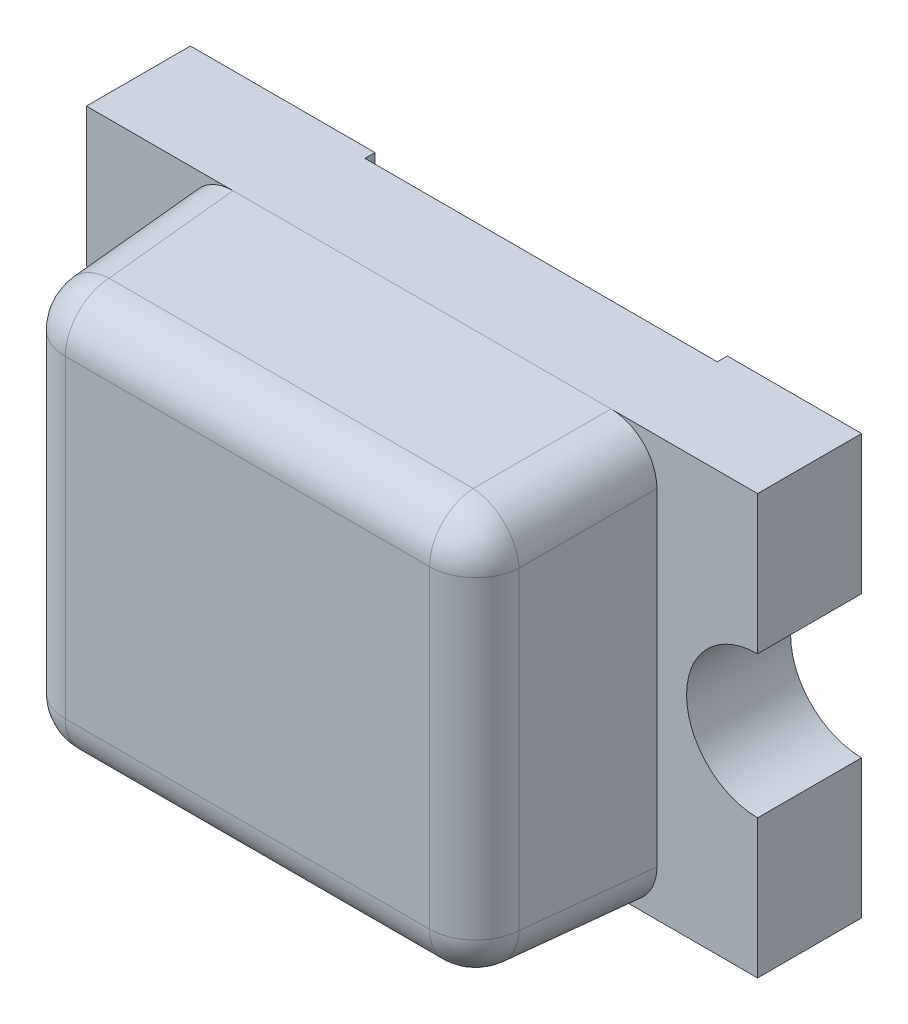
ISO-10303-21;
HEADER;
FILE_DESCRIPTION(('STEP AP214'),'2;1');
FILE_NAME('part.step','',(''),(''),'','','');
FILE_SCHEMA(('AUTOMOTIVE_DESIGN { 1 0 10303 214 1 1 1 1 }'));
ENDSEC;
DATA;
#1=APPLICATION_CONTEXT('core data for automotive mechanical design processes');
#2=APPLICATION_PROTOCOL_DEFINITION('international standard','automotive_design',2000,#1);
#3=PRODUCT_CONTEXT('',#1,'mechanical');
#4=PRODUCT('Part','Part','',(#3));
#5=PRODUCT_RELATED_PRODUCT_CATEGORY('part','',(#4));
#6=PRODUCT_DEFINITION_FORMATION('','',#4);
#7=PRODUCT_DEFINITION_CONTEXT('part definition',#1,'design');
#8=PRODUCT_DEFINITION('design','',#6,#7);
#9=PRODUCT_DEFINITION_SHAPE('','',#8);
#10=(LENGTH_UNIT() NAMED_UNIT(*) SI_UNIT(.MILLI.,.METRE.));
#11=(NAMED_UNIT(*) PLANE_ANGLE_UNIT() SI_UNIT($,.RADIAN.));
#12=(NAMED_UNIT(*) SI_UNIT($,.STERADIAN.) SOLID_ANGLE_UNIT());
#13=UNCERTAINTY_MEASURE_WITH_UNIT(LENGTH_MEASURE(1.E-05),#10,'distance_accuracy_value','');
#14=(GEOMETRIC_REPRESENTATION_CONTEXT(3) GLOBAL_UNCERTAINTY_ASSIGNED_CONTEXT((#13)) GLOBAL_UNIT_ASSIGNED_CONTEXT((#10,
#11,#12)) REPRESENTATION_CONTEXT('',''));
#15=CARTESIAN_POINT('',(0.,0.,0.));
#16=DIRECTION('',(0.,0.,1.));
#17=DIRECTION('',(1.,0.,0.));
#18=AXIS2_PLACEMENT_3D('',#15,#16,#17);
#19=CARTESIAN_POINT('',(0.163168531233106,-0.486831468766896,0.325652261310296));
#20=DIRECTION('',(-0.0522644276887139,-0.0522644276887139,-0.997264688634237));
#21=DIRECTION('',(0.,0.998629534754574,-0.0523359562429438));
#22=AXIS2_PLACEMENT_3D('',#19,#20,#21);
#23=CYLINDRICAL_SURFACE('',#22,0.13716);
#24=CARTESIAN_POINT('',(0.182412025197795,-0.467587974802207,0.69284));
#25=DIRECTION('',(0.052264427688714,0.052264427688714,0.997264688634237));
#26=DIRECTION('',(0.,-0.998629534754574,0.0523359562429439));
#27=AXIS2_PLACEMENT_3D('',#24,#25,#26);
#28=CIRCLE('',#27,0.13716);
#29=CARTESIAN_POINT('',(0.0454399982108576,-0.467587974802207,0.700018399758282));
#30=VERTEX_POINT('',#29);
#31=CARTESIAN_POINT('',(0.182412025197795,-0.604560001789144,0.700018399758282));
#32=VERTEX_POINT('',#31);
#33=EDGE_CURVE('E409',#30,#32,#28,.T.);
#34=ORIENTED_EDGE('',*,*,#33,.F.);
#35=DIRECTION('',(0.0522644276887139,0.0522644276887139,0.997264688634237));
#36=VECTOR('',#35,1.);
#37=CARTESIAN_POINT('',(0.02633308276625,-0.486694890246814,0.335436734478859));
#38=LINE('',#37,#36);
#39=CARTESIAN_POINT('',(0.0250000000000006,-0.488027973013064,0.31));
#40=VERTEX_POINT('',#39);
#41=EDGE_CURVE('E43',#40,#30,#38,.T.);
#42=ORIENTED_EDGE('',*,*,#41,.F.);
#43=CARTESIAN_POINT('',(0.162348230977076,-0.487651769022926,0.31));
#44=DIRECTION('',(0.,0.,1.));
#45=DIRECTION('',(-0.707106781186547,-0.707106781186548,0.));
#46=AXIS2_PLACEMENT_3D('',#43,#44,#45);
#47=ELLIPSE('',#46,0.137536204342943,0.13716);
#48=CARTESIAN_POINT('',(0.161972026986938,-0.625,0.31));
#49=VERTEX_POINT('',#48);
#50=EDGE_CURVE('E11',#40,#49,#47,.T.);
#51=ORIENTED_EDGE('',*,*,#50,.T.);
#52=DIRECTION('',(0.0522644276887139,0.0522644276887139,0.997264688634237));
#53=VECTOR('',#52,1.);
#54=CARTESIAN_POINT('',(0.163168531233106,-0.623803495753833,0.332830661068578));
#55=LINE('',#54,#53);
#56=EDGE_CURVE('E29',#49,#32,#55,.T.);
#57=ORIENTED_EDGE('',*,*,#56,.T.);
#58=EDGE_LOOP('',(#34,#42,#51,#57));
#59=FACE_BOUND('',#58,.T.);
#60=ADVANCED_FACE('F18',(#59),#23,.T.);
#61=CARTESIAN_POINT('',(0.182412025197795,-0.467587974802207,0.69284));
#62=DIRECTION('',(0.,0.,1.));
#63=DIRECTION('',(1.,0.,0.));
#64=AXIS2_PLACEMENT_3D('',#61,#62,#63);
#65=SPHERICAL_SURFACE('',#64,0.13716);
#66=CARTESIAN_POINT('',(0.182412025197795,-0.467587974802207,0.69284));
#67=DIRECTION('',(-1.,0.,0.));
#68=DIRECTION('',(0.,0.,1.));
#69=AXIS2_PLACEMENT_3D('',#66,#67,#68);
#70=CIRCLE('',#69,0.13716);
#71=CARTESIAN_POINT('',(0.182412025197795,-0.467587974802207,0.83));
#72=VERTEX_POINT('',#71);
#73=EDGE_CURVE('E327',#32,#72,#70,.T.);
#74=ORIENTED_EDGE('',*,*,#73,.T.);
#75=CARTESIAN_POINT('',(0.182412025197795,-0.467587974802207,0.69284));
#76=DIRECTION('',(0.,-1.,0.));
#77=DIRECTION('',(0.,0.,-1.));
#78=AXIS2_PLACEMENT_3D('',#75,#76,#77);
#79=CIRCLE('',#78,0.13716);
#80=EDGE_CURVE('E331',#72,#30,#79,.T.);
#81=ORIENTED_EDGE('',*,*,#80,.T.);
#82=ORIENTED_EDGE('',*,*,#33,.T.);
#83=EDGE_LOOP('',(#74,#81,#82));
#84=FACE_BOUND('',#83,.T.);
#85=ADVANCED_FACE('F615',(#84),#65,.T.);
#86=CARTESIAN_POINT('',(0.,-0.467587974802207,0.69284));
#87=DIRECTION('',(1.,0.,0.));
#88=DIRECTION('',(0.,1.,0.));
#89=AXIS2_PLACEMENT_3D('',#86,#87,#88);
#90=CYLINDRICAL_SURFACE('',#89,0.13716);
#91=CARTESIAN_POINT('',(1.26758797480221,-0.467587974802207,0.69284));
#92=DIRECTION('',(1.,0.,0.));
#93=DIRECTION('',(0.,0.,-1.));
#94=AXIS2_PLACEMENT_3D('',#91,#92,#93);
#95=CIRCLE('',#94,0.13716);
#96=CARTESIAN_POINT('',(1.26758797480221,-0.467587974802207,0.83));
#97=VERTEX_POINT('',#96);
#98=CARTESIAN_POINT('',(1.26758797480221,-0.604560001789144,0.700018399758282));
#99=VERTEX_POINT('',#98);
#100=EDGE_CURVE('E257',#97,#99,#95,.T.);
#101=ORIENTED_EDGE('',*,*,#100,.F.);
#102=DIRECTION('',(-1.,0.,0.));
#103=VECTOR('',#102,1.);
#104=CARTESIAN_POINT('',(1.39774795477282,-0.467587974802207,0.83));
#105=LINE('',#104,#103);
#106=EDGE_CURVE('E22',#97,#72,#105,.T.);
#107=ORIENTED_EDGE('',*,*,#106,.T.);
#108=ORIENTED_EDGE('',*,*,#73,.F.);
#109=DIRECTION('',(1.,0.,0.));
#110=VECTOR('',#109,1.);
#111=CARTESIAN_POINT('',(0.0522520452271821,-0.604560001789144,0.700018399758282));
#112=LINE('',#111,#110);
#113=EDGE_CURVE('E290',#32,#99,#112,.T.);
#114=ORIENTED_EDGE('',*,*,#113,.T.);
#115=EDGE_LOOP('',(#101,#107,#108,#114));
#116=FACE_BOUND('',#115,.T.);
#117=ADVANCED_FACE('F679',(#116),#90,.T.);
#118=CARTESIAN_POINT('',(0.182412025197795,0.,0.69284));
#119=DIRECTION('',(0.,-1.,0.));
#120=DIRECTION('',(1.,0.,0.));
#121=AXIS2_PLACEMENT_3D('',#118,#119,#120);
#122=CYLINDRICAL_SURFACE('',#121,0.13716);
#123=CARTESIAN_POINT('',(0.182412025197795,0.467587974802206,0.69284));
#124=DIRECTION('',(0.,1.,0.));
#125=DIRECTION('',(0.,0.,1.));
#126=AXIS2_PLACEMENT_3D('',#123,#124,#125);
#127=CIRCLE('',#126,0.13716);
#128=CARTESIAN_POINT('',(0.0454399982108576,0.467587974802206,0.700018399758282));
#129=VERTEX_POINT('',#128);
#130=CARTESIAN_POINT('',(0.182412025197795,0.467587974802206,0.83));
#131=VERTEX_POINT('',#130);
#132=EDGE_CURVE('E264',#129,#131,#127,.T.);
#133=ORIENTED_EDGE('',*,*,#132,.F.);
#134=DIRECTION('',(0.,-1.,0.));
#135=VECTOR('',#134,1.);
#136=CARTESIAN_POINT('',(0.0454399982108575,0.597747954772819,0.700018399758282));
#137=LINE('',#136,#135);
#138=EDGE_CURVE('E268',#129,#30,#137,.T.);
#139=ORIENTED_EDGE('',*,*,#138,.T.);
#140=ORIENTED_EDGE('',*,*,#80,.F.);
#141=DIRECTION('',(0.,1.,0.));
#142=VECTOR('',#141,1.);
#143=CARTESIAN_POINT('',(0.182412025197795,-0.597747954772819,0.83));
#144=LINE('',#143,#142);
#145=EDGE_CURVE('E270',#72,#131,#144,.T.);
#146=ORIENTED_EDGE('',*,*,#145,.T.);
#147=EDGE_LOOP('',(#133,#139,#140,#146));
#148=FACE_BOUND('',#147,.T.);
#149=ADVANCED_FACE('F266',(#148),#122,.T.);
#150=CARTESIAN_POINT('',(1.26758797480221,-0.467587974802207,0.69284));
#151=DIRECTION('',(0.,0.,1.));
#152=DIRECTION('',(1.,0.,0.));
#153=AXIS2_PLACEMENT_3D('',#150,#151,#152);
#154=SPHERICAL_SURFACE('',#153,0.13716);
#155=CARTESIAN_POINT('',(1.26758797480221,-0.467587974802206,0.69284));
#156=DIRECTION('',(-0.052264427688714,0.052264427688714,0.997264688634237));
#157=DIRECTION('',(0.,-0.998629534754574,0.0523359562429439));
#158=AXIS2_PLACEMENT_3D('',#155,#156,#157);
#159=CIRCLE('',#158,0.13716);
#160=CARTESIAN_POINT('',(1.40456000178914,-0.467587974802207,0.700018399758282));
#161=VERTEX_POINT('',#160);
#162=EDGE_CURVE('E366',#99,#161,#159,.T.);
#163=ORIENTED_EDGE('',*,*,#162,.T.);
#164=CARTESIAN_POINT('',(1.26758797480221,-0.467587974802207,0.69284));
#165=DIRECTION('',(0.,-1.,0.));
#166=DIRECTION('',(0.,0.,-1.));
#167=AXIS2_PLACEMENT_3D('',#164,#165,#166);
#168=CIRCLE('',#167,0.13716);
#169=EDGE_CURVE('E387',#161,#97,#168,.T.);
#170=ORIENTED_EDGE('',*,*,#169,.T.);
#171=ORIENTED_EDGE('',*,*,#100,.T.);
#172=EDGE_LOOP('',(#163,#170,#171));
#173=FACE_BOUND('',#172,.T.);
#174=ADVANCED_FACE('F680',(#173),#154,.T.);
#175=CARTESIAN_POINT('',(0.182412025197795,0.467587974802206,0.69284));
#176=DIRECTION('',(0.,0.,1.));
#177=DIRECTION('',(1.,0.,0.));
#178=AXIS2_PLACEMENT_3D('',#175,#176,#177);
#179=SPHERICAL_SURFACE('',#178,0.13716);
#180=CARTESIAN_POINT('',(0.182412025197795,0.467587974802206,0.69284));
#181=DIRECTION('',(-1.,0.,0.));
#182=DIRECTION('',(0.,-1.,0.));
#183=AXIS2_PLACEMENT_3D('',#180,#181,#182);
#184=CIRCLE('',#183,0.13716);
#185=CARTESIAN_POINT('',(0.182412025197795,0.604560001789144,0.700018399758282));
#186=VERTEX_POINT('',#185);
#187=EDGE_CURVE('E281',#131,#186,#184,.T.);
#188=ORIENTED_EDGE('',*,*,#187,.T.);
#189=CARTESIAN_POINT('',(0.182412025197795,0.467587974802206,0.69284));
#190=DIRECTION('',(0.052264427688714,-0.052264427688714,0.997264688634237));
#191=DIRECTION('',(0.998629534754574,0.,-0.0523359562429439));
#192=AXIS2_PLACEMENT_3D('',#189,#190,#191);
#193=CIRCLE('',#192,0.13716);
#194=EDGE_CURVE('E276',#186,#129,#193,.T.);
#195=ORIENTED_EDGE('',*,*,#194,.T.);
#196=ORIENTED_EDGE('',*,*,#132,.T.);
#197=EDGE_LOOP('',(#188,#195,#196));
#198=FACE_BOUND('',#197,.T.);
#199=ADVANCED_FACE('F280',(#198),#179,.T.);
#200=CARTESIAN_POINT('',(1.28669489024681,-0.486694890246814,0.328258334720577));
#201=DIRECTION('',(0.0522644276887139,-0.0522644276887139,-0.997264688634237));
#202=DIRECTION('',(-0.998629534754574,0.,-0.0523359562429438));
#203=AXIS2_PLACEMENT_3D('',#200,#201,#202);
#204=CYLINDRICAL_SURFACE('',#203,0.13716);
#205=CARTESIAN_POINT('',(1.28765176902293,-0.487651769022926,0.31));
#206=DIRECTION('',(0.,0.,1.));
#207=DIRECTION('',(0.707106781186548,-0.707106781186547,0.));
#208=AXIS2_PLACEMENT_3D('',#205,#206,#207);
#209=ELLIPSE('',#208,0.137536204342943,0.13716);
#210=CARTESIAN_POINT('',(1.28802797301306,-0.625,0.31));
#211=VERTEX_POINT('',#210);
#212=CARTESIAN_POINT('',(1.425,-0.488027973013063,0.31));
#213=VERTEX_POINT('',#212);
#214=EDGE_CURVE('E277',#211,#213,#209,.T.);
#215=ORIENTED_EDGE('',*,*,#214,.T.);
#216=DIRECTION('',(-0.0522644276887139,0.0522644276887139,0.997264688634237));
#217=VECTOR('',#216,1.);
#218=CARTESIAN_POINT('',(1.42366691723375,-0.486694890246814,0.335436734478859));
#219=LINE('',#218,#217);
#220=EDGE_CURVE('E437',#213,#161,#219,.T.);
#221=ORIENTED_EDGE('',*,*,#220,.T.);
#222=ORIENTED_EDGE('',*,*,#162,.F.);
#223=DIRECTION('',(-0.0522644276887139,0.0522644276887139,0.997264688634237));
#224=VECTOR('',#223,1.);
#225=CARTESIAN_POINT('',(1.28614857616649,-0.623120603153426,0.345861028119986));
#226=LINE('',#225,#224);
#227=EDGE_CURVE('E520',#211,#99,#226,.T.);
#228=ORIENTED_EDGE('',*,*,#227,.F.);
#229=EDGE_LOOP('',(#215,#221,#222,#228));
#230=FACE_BOUND('',#229,.T.);
#231=ADVANCED_FACE('F676',(#230),#204,.T.);
#232=CARTESIAN_POINT('',(1.26758797480221,0.,0.69284));
#233=DIRECTION('',(0.,1.,0.));
#234=DIRECTION('',(-1.,0.,0.));
#235=AXIS2_PLACEMENT_3D('',#232,#233,#234);
#236=CYLINDRICAL_SURFACE('',#235,0.13716);
#237=CARTESIAN_POINT('',(1.26758797480221,0.467587974802206,0.69284));
#238=DIRECTION('',(0.,1.,0.));
#239=DIRECTION('',(0.,0.,1.));
#240=AXIS2_PLACEMENT_3D('',#237,#238,#239);
#241=CIRCLE('',#240,0.13716);
#242=CARTESIAN_POINT('',(1.26758797480221,0.467587974802206,0.83));
#243=VERTEX_POINT('',#242);
#244=CARTESIAN_POINT('',(1.40456000178914,0.467587974802206,0.700018399758282));
#245=VERTEX_POINT('',#244);
#246=EDGE_CURVE('E297',#243,#245,#241,.T.);
#247=ORIENTED_EDGE('',*,*,#246,.F.);
#248=DIRECTION('',(0.,-1.,0.));
#249=VECTOR('',#248,1.);
#250=CARTESIAN_POINT('',(1.26758797480221,0.597747954772819,0.83));
#251=LINE('',#250,#249);
#252=EDGE_CURVE('E434',#243,#97,#251,.T.);
#253=ORIENTED_EDGE('',*,*,#252,.T.);
#254=ORIENTED_EDGE('',*,*,#169,.F.);
#255=DIRECTION('',(0.,1.,0.));
#256=VECTOR('',#255,1.);
#257=CARTESIAN_POINT('',(1.40456000178914,-0.597747954772819,0.700018399758282));
#258=LINE('',#257,#256);
#259=EDGE_CURVE('E438',#161,#245,#258,.T.);
#260=ORIENTED_EDGE('',*,*,#259,.T.);
#261=EDGE_LOOP('',(#247,#253,#254,#260));
#262=FACE_BOUND('',#261,.T.);
#263=ADVANCED_FACE('F684',(#262),#236,.T.);
#264=CARTESIAN_POINT('',(0.,0.467587974802206,0.69284));
#265=DIRECTION('',(-1.,0.,0.));
#266=DIRECTION('',(0.,0.,1.));
#267=AXIS2_PLACEMENT_3D('',#264,#265,#266);
#268=CYLINDRICAL_SURFACE('',#267,0.13716);
#269=CARTESIAN_POINT('',(1.26758797480221,0.467587974802206,0.69284));
#270=DIRECTION('',(1.,0.,0.));
#271=DIRECTION('',(0.,0.,-1.));
#272=AXIS2_PLACEMENT_3D('',#269,#270,#271);
#273=CIRCLE('',#272,0.13716);
#274=CARTESIAN_POINT('',(1.26758797480221,0.604560001789144,0.700018399758282));
#275=VERTEX_POINT('',#274);
#276=EDGE_CURVE('E394',#275,#243,#273,.T.);
#277=ORIENTED_EDGE('',*,*,#276,.F.);
#278=DIRECTION('',(-1.,0.,0.));
#279=VECTOR('',#278,1.);
#280=CARTESIAN_POINT('',(1.39774795477282,0.604560001789144,0.700018399758282));
#281=LINE('',#280,#279);
#282=EDGE_CURVE('E447',#275,#186,#281,.T.);
#283=ORIENTED_EDGE('',*,*,#282,.T.);
#284=ORIENTED_EDGE('',*,*,#187,.F.);
#285=DIRECTION('',(1.,0.,0.));
#286=VECTOR('',#285,1.);
#287=CARTESIAN_POINT('',(0.052252045227182,0.467587974802206,0.83));
#288=LINE('',#287,#286);
#289=EDGE_CURVE('E303',#131,#243,#288,.T.);
#290=ORIENTED_EDGE('',*,*,#289,.T.);
#291=EDGE_LOOP('',(#277,#283,#284,#290));
#292=FACE_BOUND('',#291,.T.);
#293=ADVANCED_FACE('F622',(#292),#268,.T.);
#294=CARTESIAN_POINT('',(0.163305109753187,0.486694890246814,0.328258334720577));
#295=DIRECTION('',(-0.0522644276887139,0.0522644276887139,-0.997264688634237));
#296=DIRECTION('',(-0.998629534754574,0.,0.0523359562429438));
#297=AXIS2_PLACEMENT_3D('',#294,#295,#296);
#298=CYLINDRICAL_SURFACE('',#297,0.13716);
#299=CARTESIAN_POINT('',(0.162348230977075,0.487651769022926,0.31));
#300=DIRECTION('',(0.,0.,1.));
#301=DIRECTION('',(-0.707106781186548,0.707106781186548,0.));
#302=AXIS2_PLACEMENT_3D('',#299,#300,#301);
#303=ELLIPSE('',#302,0.137536204342943,0.13716);
#304=CARTESIAN_POINT('',(0.161972026986938,0.625,0.31));
#305=VERTEX_POINT('',#304);
#306=CARTESIAN_POINT('',(0.0250000000000006,0.488027973013063,0.31));
#307=VERTEX_POINT('',#306);
#308=EDGE_CURVE('E294',#305,#307,#303,.T.);
#309=ORIENTED_EDGE('',*,*,#308,.T.);
#310=DIRECTION('',(0.0522644276887139,-0.0522644276887139,0.997264688634237));
#311=VECTOR('',#310,1.);
#312=CARTESIAN_POINT('',(0.02633308276625,0.486694890246814,0.335436734478859));
#313=LINE('',#312,#311);
#314=EDGE_CURVE('E287',#307,#129,#313,.T.);
#315=ORIENTED_EDGE('',*,*,#314,.T.);
#316=ORIENTED_EDGE('',*,*,#194,.F.);
#317=DIRECTION('',(0.0522644276887139,-0.0522644276887139,0.997264688634237));
#318=VECTOR('',#317,1.);
#319=CARTESIAN_POINT('',(0.163168531233106,0.623803495753833,0.332830661068578));
#320=LINE('',#319,#318);
#321=EDGE_CURVE('E519',#305,#186,#320,.T.);
#322=ORIENTED_EDGE('',*,*,#321,.F.);
#323=EDGE_LOOP('',(#309,#315,#316,#322));
#324=FACE_BOUND('',#323,.T.);
#325=ADVANCED_FACE('F292',(#324),#298,.T.);
#326=CARTESIAN_POINT('',(1.26758797480221,0.467587974802206,0.69284));
#327=DIRECTION('',(0.,0.,1.));
#328=DIRECTION('',(1.,0.,0.));
#329=AXIS2_PLACEMENT_3D('',#326,#327,#328);
#330=SPHERICAL_SURFACE('',#329,0.13716);
#331=ORIENTED_EDGE('',*,*,#246,.T.);
#332=CARTESIAN_POINT('',(1.26758797480221,0.467587974802206,0.69284));
#333=DIRECTION('',(-0.052264427688714,-0.0522644276887141,0.997264688634237));
#334=DIRECTION('',(0.,-0.998629534754574,-0.052335956242944));
#335=AXIS2_PLACEMENT_3D('',#332,#333,#334);
#336=CIRCLE('',#335,0.13716);
#337=EDGE_CURVE('E307',#245,#275,#336,.T.);
#338=ORIENTED_EDGE('',*,*,#337,.T.);
#339=ORIENTED_EDGE('',*,*,#276,.T.);
#340=EDGE_LOOP('',(#331,#338,#339));
#341=FACE_BOUND('',#340,.T.);
#342=ADVANCED_FACE('F686',(#341),#330,.T.);
#343=CARTESIAN_POINT('',(1.28614857616649,0.486148576166488,0.338682628361704));
#344=DIRECTION('',(0.0522644276887139,0.0522644276887139,-0.997264688634237));
#345=DIRECTION('',(0.,0.998629534754574,0.0523359562429438));
#346=AXIS2_PLACEMENT_3D('',#343,#344,#345);
#347=CYLINDRICAL_SURFACE('',#346,0.13716);
#348=ORIENTED_EDGE('',*,*,#337,.F.);
#349=DIRECTION('',(-0.0522644276887139,-0.0522644276887139,0.997264688634237));
#350=VECTOR('',#349,1.);
#351=CARTESIAN_POINT('',(1.42366691723375,0.486694890246814,0.335436734478859));
#352=LINE('',#351,#350);
#353=CARTESIAN_POINT('',(1.425,0.488027973013063,0.31));
#354=VERTEX_POINT('',#353);
#355=EDGE_CURVE('E86',#354,#245,#352,.T.);
#356=ORIENTED_EDGE('',*,*,#355,.F.);
#357=CARTESIAN_POINT('',(1.28765176902293,0.487651769022926,0.31));
#358=DIRECTION('',(0.,0.,1.));
#359=DIRECTION('',(0.707106781186548,0.707106781186548,0.));
#360=AXIS2_PLACEMENT_3D('',#357,#358,#359);
#361=ELLIPSE('',#360,0.137536204342943,0.13716);
#362=CARTESIAN_POINT('',(1.28802797301306,0.625,0.31));
#363=VERTEX_POINT('',#362);
#364=EDGE_CURVE('E397',#354,#363,#361,.T.);
#365=ORIENTED_EDGE('',*,*,#364,.T.);
#366=DIRECTION('',(-0.0522644276887139,-0.0522644276887139,0.997264688634237));
#367=VECTOR('',#366,1.);
#368=CARTESIAN_POINT('',(1.28614857616649,0.623120603153425,0.345861028119986));
#369=LINE('',#368,#367);
#370=EDGE_CURVE('E563',#363,#275,#369,.T.);
#371=ORIENTED_EDGE('',*,*,#370,.T.);
#372=EDGE_LOOP('',(#348,#356,#365,#371));
#373=FACE_BOUND('',#372,.T.);
#374=ADVANCED_FACE('F625',(#373),#347,.T.);
#375=CARTESIAN_POINT('',(0.,0.,0.83));
#376=DIRECTION('',(0.,0.,1.));
#377=DIRECTION('',(1.,0.,0.));
#378=AXIS2_PLACEMENT_3D('',#375,#376,#377);
#379=PLANE('',#378);
#380=ORIENTED_EDGE('',*,*,#145,.F.);
#381=ORIENTED_EDGE('',*,*,#106,.F.);
#382=ORIENTED_EDGE('',*,*,#252,.F.);
#383=ORIENTED_EDGE('',*,*,#289,.F.);
#384=EDGE_LOOP('',(#380,#381,#382,#383));
#385=FACE_BOUND('',#384,.T.);
#386=ADVANCED_FACE('F619',(#385),#379,.T.);
#387=CARTESIAN_POINT('',(0.6,0.625,0.31));
#388=DIRECTION('',(0.,0.998629534754574,0.0523359562429438));
#389=DIRECTION('',(1.,0.,0.));
#390=AXIS2_PLACEMENT_3D('',#387,#388,#389);
#391=PLANE('',#390);
#392=DIRECTION('',(1.,0.,0.));
#393=VECTOR('',#392,1.);
#394=CARTESIAN_POINT('',(0.6,0.625,0.31));
#395=LINE('',#394,#393);
#396=EDGE_CURVE('E71',#305,#363,#395,.T.);
#397=ORIENTED_EDGE('',*,*,#396,.F.);
#398=ORIENTED_EDGE('',*,*,#321,.T.);
#399=ORIENTED_EDGE('',*,*,#282,.F.);
#400=ORIENTED_EDGE('',*,*,#370,.F.);
#401=EDGE_LOOP('',(#397,#398,#399,#400));
#402=FACE_BOUND('',#401,.T.);
#403=ADVANCED_FACE('F624',(#402),#391,.T.);
#404=CARTESIAN_POINT('',(1.425,0.,0.31));
#405=DIRECTION('',(0.998629534754574,0.,0.0523359562429438));
#406=DIRECTION('',(0.,-1.,0.));
#407=AXIS2_PLACEMENT_3D('',#404,#405,#406);
#408=PLANE('',#407);
#409=ORIENTED_EDGE('',*,*,#259,.F.);
#410=ORIENTED_EDGE('',*,*,#220,.F.);
#411=DIRECTION('',(0.,-1.,0.));
#412=VECTOR('',#411,1.);
#413=CARTESIAN_POINT('',(1.425,0.,0.31));
#414=LINE('',#413,#412);
#415=EDGE_CURVE('E479',#354,#213,#414,.T.);
#416=ORIENTED_EDGE('',*,*,#415,.F.);
#417=ORIENTED_EDGE('',*,*,#355,.T.);
#418=EDGE_LOOP('',(#409,#410,#416,#417));
#419=FACE_BOUND('',#418,.T.);
#420=ADVANCED_FACE('F758',(#419),#408,.T.);
#421=CARTESIAN_POINT('',(0.6,-0.625,0.31));
#422=DIRECTION('',(0.,-0.998629534754574,0.0523359562429438));
#423=DIRECTION('',(-1.,0.,0.));
#424=AXIS2_PLACEMENT_3D('',#421,#422,#423);
#425=PLANE('',#424);
#426=ORIENTED_EDGE('',*,*,#113,.F.);
#427=ORIENTED_EDGE('',*,*,#56,.F.);
#428=DIRECTION('',(-1.,0.,0.));
#429=VECTOR('',#428,1.);
#430=CARTESIAN_POINT('',(0.6,-0.625,0.31));
#431=LINE('',#430,#429);
#432=EDGE_CURVE('E378',#211,#49,#431,.T.);
#433=ORIENTED_EDGE('',*,*,#432,.F.);
#434=ORIENTED_EDGE('',*,*,#227,.T.);
#435=EDGE_LOOP('',(#426,#427,#433,#434));
#436=FACE_BOUND('',#435,.T.);
#437=ADVANCED_FACE('F20',(#436),#425,.T.);
#438=CARTESIAN_POINT('',(0.0250000000000006,0.,0.31));
#439=DIRECTION('',(-0.998629534754574,0.,0.0523359562429438));
#440=DIRECTION('',(0.,1.,0.));
#441=AXIS2_PLACEMENT_3D('',#438,#439,#440);
#442=PLANE('',#441);
#443=DIRECTION('',(0.,1.,0.));
#444=VECTOR('',#443,1.);
#445=CARTESIAN_POINT('',(0.0250000000000006,0.,0.31));
#446=LINE('',#445,#444);
#447=EDGE_CURVE('E314',#40,#307,#446,.T.);
#448=ORIENTED_EDGE('',*,*,#447,.F.);
#449=ORIENTED_EDGE('',*,*,#41,.T.);
#450=ORIENTED_EDGE('',*,*,#138,.F.);
#451=ORIENTED_EDGE('',*,*,#314,.F.);
#452=EDGE_LOOP('',(#448,#449,#450,#451));
#453=FACE_BOUND('',#452,.T.);
#454=ADVANCED_FACE('F286',(#453),#442,.T.);
#455=CARTESIAN_POINT('',(-0.275,0.,0.));
#456=DIRECTION('',(0.,0.,1.));
#457=DIRECTION('',(1.,0.,0.));
#458=AXIS2_PLACEMENT_3D('',#455,#456,#457);
#459=PLANE('',#458);
#460=DIRECTION('',(0.,1.,0.));
#461=VECTOR('',#460,1.);
#462=CARTESIAN_POINT('',(-0.275,0.211688070581402,0.));
#463=LINE('',#462,#461);
#464=CARTESIAN_POINT('',(-0.275,0.211688070581401,0.));
#465=VERTEX_POINT('',#464);
#466=CARTESIAN_POINT('',(-0.275,0.625,0.));
#467=VERTEX_POINT('',#466);
#468=EDGE_CURVE('E443',#465,#467,#463,.T.);
#469=ORIENTED_EDGE('',*,*,#468,.T.);
#470=DIRECTION('',(1.,0.,0.));
#471=VECTOR('',#470,1.);
#472=CARTESIAN_POINT('',(-0.275,0.625,0.));
#473=LINE('',#472,#471);
#474=CARTESIAN_POINT('',(0.275,0.625,0.));
#475=VERTEX_POINT('',#474);
#476=EDGE_CURVE('E439',#467,#475,#473,.T.);
#477=ORIENTED_EDGE('',*,*,#476,.T.);
#478=DIRECTION('',(0.,-1.,0.));
#479=VECTOR('',#478,1.);
#480=CARTESIAN_POINT('',(0.275,0.625,0.));
#481=LINE('',#480,#479);
#482=CARTESIAN_POINT('',(0.275,-0.625,0.));
#483=VERTEX_POINT('',#482);
#484=EDGE_CURVE('E325',#475,#483,#481,.T.);
#485=ORIENTED_EDGE('',*,*,#484,.T.);
#486=DIRECTION('',(-1.,0.,0.));
#487=VECTOR('',#486,1.);
#488=CARTESIAN_POINT('',(0.275,-0.625,0.));
#489=LINE('',#488,#487);
#490=CARTESIAN_POINT('',(-0.275,-0.625,0.));
#491=VERTEX_POINT('',#490);
#492=EDGE_CURVE('E321',#483,#491,#489,.T.);
#493=ORIENTED_EDGE('',*,*,#492,.T.);
#494=DIRECTION('',(0.,1.,0.));
#495=VECTOR('',#494,1.);
#496=CARTESIAN_POINT('',(-0.275,-0.625,0.));
#497=LINE('',#496,#495);
#498=CARTESIAN_POINT('',(-0.275,-0.211688070581402,0.));
#499=VERTEX_POINT('',#498);
#500=EDGE_CURVE('E326',#491,#499,#497,.T.);
#501=ORIENTED_EDGE('',*,*,#500,.T.);
#502=CARTESIAN_POINT('',(-0.275,0.,0.));
#503=DIRECTION('',(0.,0.,1.));
#504=DIRECTION('',(-1.,0.,0.));
#505=AXIS2_PLACEMENT_3D('',#502,#503,#504);
#506=CIRCLE('',#505,0.211688070581401);
#507=EDGE_CURVE('E457',#499,#465,#506,.T.);
#508=ORIENTED_EDGE('',*,*,#507,.T.);
#509=EDGE_LOOP('',(#469,#477,#485,#493,#501,#508));
#510=FACE_BOUND('',#509,.T.);
#511=ADVANCED_FACE('F602',(#510),#459,.F.);
#512=CARTESIAN_POINT('',(-0.275,0.,0.03));
#513=DIRECTION('',(0.,0.,-1.));
#514=DIRECTION('',(-1.,0.,0.));
#515=AXIS2_PLACEMENT_3D('',#512,#513,#514);
#516=CYLINDRICAL_SURFACE('',#515,0.211688070581401);
#517=ORIENTED_EDGE('',*,*,#507,.F.);
#518=DIRECTION('',(0.,0.,-1.));
#519=VECTOR('',#518,1.);
#520=CARTESIAN_POINT('',(-0.275,-0.211688070581402,0.03));
#521=LINE('',#520,#519);
#522=CARTESIAN_POINT('',(-0.275,-0.211688070581402,0.31));
#523=VERTEX_POINT('',#522);
#524=EDGE_CURVE('E336',#523,#499,#521,.T.);
#525=ORIENTED_EDGE('',*,*,#524,.F.);
#526=CARTESIAN_POINT('',(-0.275,0.,0.31));
#527=DIRECTION('',(0.,0.,1.));
#528=DIRECTION('',(-1.,0.,0.));
#529=AXIS2_PLACEMENT_3D('',#526,#527,#528);
#530=CIRCLE('',#529,0.211688070581401);
#531=CARTESIAN_POINT('',(-0.275,0.211688070581401,0.31));
#532=VERTEX_POINT('',#531);
#533=EDGE_CURVE('E488',#523,#532,#530,.T.);
#534=ORIENTED_EDGE('',*,*,#533,.T.);
#535=DIRECTION('',(0.,0.,-1.));
#536=VECTOR('',#535,1.);
#537=CARTESIAN_POINT('',(-0.275,0.211688070581401,0.03));
#538=LINE('',#537,#536);
#539=EDGE_CURVE('E492',#532,#465,#538,.T.);
#540=ORIENTED_EDGE('',*,*,#539,.T.);
#541=EDGE_LOOP('',(#517,#525,#534,#540));
#542=FACE_BOUND('',#541,.T.);
#543=ADVANCED_FACE('F592',(#542),#516,.F.);
#544=CARTESIAN_POINT('',(-0.275,-0.625,0.03));
#545=DIRECTION('',(-1.,0.,0.));
#546=DIRECTION('',(0.,0.,1.));
#547=AXIS2_PLACEMENT_3D('',#544,#545,#546);
#548=PLANE('',#547);
#549=ORIENTED_EDGE('',*,*,#500,.F.);
#550=DIRECTION('',(0.,0.,-1.));
#551=VECTOR('',#550,1.);
#552=CARTESIAN_POINT('',(-0.275,-0.625,0.03));
#553=LINE('',#552,#551);
#554=CARTESIAN_POINT('',(-0.275,-0.625,0.31));
#555=VERTEX_POINT('',#554);
#556=EDGE_CURVE('E473',#555,#491,#553,.T.);
#557=ORIENTED_EDGE('',*,*,#556,.F.);
#558=DIRECTION('',(0.,1.,0.));
#559=VECTOR('',#558,1.);
#560=CARTESIAN_POINT('',(-0.275,-0.211688070581402,0.31));
#561=LINE('',#560,#559);
#562=EDGE_CURVE('E524',#555,#523,#561,.T.);
#563=ORIENTED_EDGE('',*,*,#562,.T.);
#564=ORIENTED_EDGE('',*,*,#524,.T.);
#565=EDGE_LOOP('',(#549,#557,#563,#564));
#566=FACE_BOUND('',#565,.T.);
#567=ADVANCED_FACE('F588',(#566),#548,.T.);
#568=CARTESIAN_POINT('',(0.275,-0.625,0.03));
#569=DIRECTION('',(0.,-1.,0.));
#570=DIRECTION('',(0.,0.,-1.));
#571=AXIS2_PLACEMENT_3D('',#568,#569,#570);
#572=PLANE('',#571);
#573=ORIENTED_EDGE('',*,*,#492,.F.);
#574=DIRECTION('',(0.,0.,-1.));
#575=VECTOR('',#574,1.);
#576=CARTESIAN_POINT('',(0.275,-0.625,0.03));
#577=LINE('',#576,#575);
#578=CARTESIAN_POINT('',(0.275,-0.625,0.03));
#579=VERTEX_POINT('',#578);
#580=EDGE_CURVE('E410',#579,#483,#577,.T.);
#581=ORIENTED_EDGE('',*,*,#580,.F.);
#582=DIRECTION('',(-1.,0.,0.));
#583=VECTOR('',#582,1.);
#584=CARTESIAN_POINT('',(1.725,-0.625,0.03));
#585=LINE('',#584,#583);
#586=CARTESIAN_POINT('',(1.325,-0.625,0.03));
#587=VERTEX_POINT('',#586);
#588=EDGE_CURVE('E476',#587,#579,#585,.T.);
#589=ORIENTED_EDGE('',*,*,#588,.F.);
#590=DIRECTION('',(0.,0.,-1.));
#591=VECTOR('',#590,1.);
#592=CARTESIAN_POINT('',(1.325,-0.625,0.03));
#593=LINE('',#592,#591);
#594=CARTESIAN_POINT('',(1.325,-0.625,0.));
#595=VERTEX_POINT('',#594);
#596=EDGE_CURVE('E332',#587,#595,#593,.T.);
#597=ORIENTED_EDGE('',*,*,#596,.T.);
#598=DIRECTION('',(-1.,0.,0.));
#599=VECTOR('',#598,1.);
#600=CARTESIAN_POINT('',(1.725,-0.625,0.));
#601=LINE('',#600,#599);
#602=CARTESIAN_POINT('',(1.725,-0.625,0.));
#603=VERTEX_POINT('',#602);
#604=EDGE_CURVE('E415',#603,#595,#601,.T.);
#605=ORIENTED_EDGE('',*,*,#604,.F.);
#606=DIRECTION('',(0.,0.,-1.));
#607=VECTOR('',#606,1.);
#608=CARTESIAN_POINT('',(1.725,-0.625,0.03));
#609=LINE('',#608,#607);
#610=CARTESIAN_POINT('',(1.725,-0.625,0.31));
#611=VERTEX_POINT('',#610);
#612=EDGE_CURVE('E398',#611,#603,#609,.T.);
#613=ORIENTED_EDGE('',*,*,#612,.F.);
#614=DIRECTION('',(-1.,0.,0.));
#615=VECTOR('',#614,1.);
#616=CARTESIAN_POINT('',(1.725,-0.625,0.31));
#617=LINE('',#616,#615);
#618=EDGE_CURVE('E337',#611,#211,#617,.T.);
#619=ORIENTED_EDGE('',*,*,#618,.T.);
#620=ORIENTED_EDGE('',*,*,#432,.T.);
#621=DIRECTION('',(-1.,0.,0.));
#622=VECTOR('',#621,1.);
#623=CARTESIAN_POINT('',(1.725,-0.625,0.31));
#624=LINE('',#623,#622);
#625=EDGE_CURVE('E469',#49,#555,#624,.T.);
#626=ORIENTED_EDGE('',*,*,#625,.T.);
#627=ORIENTED_EDGE('',*,*,#556,.T.);
#628=EDGE_LOOP('',(#573,#581,#589,#597,#605,#613,#619,#620,#626,#627));
#629=FACE_BOUND('',#628,.T.);
#630=ADVANCED_FACE('F605',(#629),#572,.T.);
#631=CARTESIAN_POINT('',(0.275,0.625,0.03));
#632=DIRECTION('',(1.,0.,0.));
#633=DIRECTION('',(0.,1.,0.));
#634=AXIS2_PLACEMENT_3D('',#631,#632,#633);
#635=PLANE('',#634);
#636=ORIENTED_EDGE('',*,*,#484,.F.);
#637=DIRECTION('',(0.,0.,-1.));
#638=VECTOR('',#637,1.);
#639=CARTESIAN_POINT('',(0.275,0.625,0.03));
#640=LINE('',#639,#638);
#641=CARTESIAN_POINT('',(0.275,0.625,0.03));
#642=VERTEX_POINT('',#641);
#643=EDGE_CURVE('E391',#642,#475,#640,.T.);
#644=ORIENTED_EDGE('',*,*,#643,.F.);
#645=DIRECTION('',(0.,-1.,0.));
#646=VECTOR('',#645,1.);
#647=CARTESIAN_POINT('',(0.275,0.625,0.03));
#648=LINE('',#647,#646);
#649=EDGE_CURVE('E413',#642,#579,#648,.T.);
#650=ORIENTED_EDGE('',*,*,#649,.T.);
#651=ORIENTED_EDGE('',*,*,#580,.T.);
#652=EDGE_LOOP('',(#636,#644,#650,#651));
#653=FACE_BOUND('',#652,.T.);
#654=ADVANCED_FACE('F639',(#653),#635,.T.);
#655=CARTESIAN_POINT('',(-0.275,0.625,0.03));
#656=DIRECTION('',(0.,1.,0.));
#657=DIRECTION('',(1.,0.,0.));
#658=AXIS2_PLACEMENT_3D('',#655,#656,#657);
#659=PLANE('',#658);
#660=ORIENTED_EDGE('',*,*,#476,.F.);
#661=DIRECTION('',(0.,0.,-1.));
#662=VECTOR('',#661,1.);
#663=CARTESIAN_POINT('',(-0.275,0.625,0.03));
#664=LINE('',#663,#662);
#665=CARTESIAN_POINT('',(-0.275,0.625,0.31));
#666=VERTEX_POINT('',#665);
#667=EDGE_CURVE('E392',#666,#467,#664,.T.);
#668=ORIENTED_EDGE('',*,*,#667,.F.);
#669=DIRECTION('',(1.,0.,0.));
#670=VECTOR('',#669,1.);
#671=CARTESIAN_POINT('',(-0.275,0.625,0.31));
#672=LINE('',#671,#670);
#673=EDGE_CURVE('E414',#666,#305,#672,.T.);
#674=ORIENTED_EDGE('',*,*,#673,.T.);
#675=ORIENTED_EDGE('',*,*,#396,.T.);
#676=DIRECTION('',(1.,0.,0.));
#677=VECTOR('',#676,1.);
#678=CARTESIAN_POINT('',(-0.275,0.625,0.31));
#679=LINE('',#678,#677);
#680=CARTESIAN_POINT('',(1.725,0.625,0.31));
#681=VERTEX_POINT('',#680);
#682=EDGE_CURVE('E505',#363,#681,#679,.T.);
#683=ORIENTED_EDGE('',*,*,#682,.T.);
#684=DIRECTION('',(0.,0.,-1.));
#685=VECTOR('',#684,1.);
#686=CARTESIAN_POINT('',(1.725,0.625,0.03));
#687=LINE('',#686,#685);
#688=CARTESIAN_POINT('',(1.725,0.625,0.));
#689=VERTEX_POINT('',#688);
#690=EDGE_CURVE('E501',#681,#689,#687,.T.);
#691=ORIENTED_EDGE('',*,*,#690,.T.);
#692=DIRECTION('',(1.,0.,0.));
#693=VECTOR('',#692,1.);
#694=CARTESIAN_POINT('',(1.325,0.625,0.));
#695=LINE('',#694,#693);
#696=CARTESIAN_POINT('',(1.325,0.625,0.));
#697=VERTEX_POINT('',#696);
#698=EDGE_CURVE('E316',#697,#689,#695,.T.);
#699=ORIENTED_EDGE('',*,*,#698,.F.);
#700=DIRECTION('',(0.,0.,-1.));
#701=VECTOR('',#700,1.);
#702=CARTESIAN_POINT('',(1.325,0.625,0.03));
#703=LINE('',#702,#701);
#704=CARTESIAN_POINT('',(1.325,0.625,0.03));
#705=VERTEX_POINT('',#704);
#706=EDGE_CURVE('E312',#705,#697,#703,.T.);
#707=ORIENTED_EDGE('',*,*,#706,.F.);
#708=DIRECTION('',(1.,0.,0.));
#709=VECTOR('',#708,1.);
#710=CARTESIAN_POINT('',(-0.275,0.625,0.03));
#711=LINE('',#710,#709);
#712=EDGE_CURVE('E463',#642,#705,#711,.T.);
#713=ORIENTED_EDGE('',*,*,#712,.F.);
#714=ORIENTED_EDGE('',*,*,#643,.T.);
#715=EDGE_LOOP('',(#660,#668,#674,#675,#683,#691,#699,#707,#713,#714));
#716=FACE_BOUND('',#715,.T.);
#717=ADVANCED_FACE('F633',(#716),#659,.T.);
#718=CARTESIAN_POINT('',(-0.275,0.211688070581402,0.03));
#719=DIRECTION('',(-1.,0.,0.));
#720=DIRECTION('',(0.,0.,1.));
#721=AXIS2_PLACEMENT_3D('',#718,#719,#720);
#722=PLANE('',#721);
#723=ORIENTED_EDGE('',*,*,#468,.F.);
#724=ORIENTED_EDGE('',*,*,#539,.F.);
#725=DIRECTION('',(0.,1.,0.));
#726=VECTOR('',#725,1.);
#727=CARTESIAN_POINT('',(-0.275,0.211688070581401,0.31));
#728=LINE('',#727,#726);
#729=EDGE_CURVE('E388',#532,#666,#728,.T.);
#730=ORIENTED_EDGE('',*,*,#729,.T.);
#731=ORIENTED_EDGE('',*,*,#667,.T.);
#732=EDGE_LOOP('',(#723,#724,#730,#731));
#733=FACE_BOUND('',#732,.T.);
#734=ADVANCED_FACE('F600',(#733),#722,.T.);
#735=CARTESIAN_POINT('',(1.725,0.,0.03));
#736=DIRECTION('',(0.,0.,1.));
#737=DIRECTION('',(1.,0.,0.));
#738=AXIS2_PLACEMENT_3D('',#735,#736,#737);
#739=PLANE('',#738);
#740=ORIENTED_EDGE('',*,*,#649,.F.);
#741=ORIENTED_EDGE('',*,*,#712,.T.);
#742=DIRECTION('',(0.,1.,0.));
#743=VECTOR('',#742,1.);
#744=CARTESIAN_POINT('',(1.325,0.2,0.03));
#745=LINE('',#744,#743);
#746=CARTESIAN_POINT('',(1.325,0.2,0.03));
#747=VERTEX_POINT('',#746);
#748=EDGE_CURVE('E313',#747,#705,#745,.T.);
#749=ORIENTED_EDGE('',*,*,#748,.F.);
#750=DIRECTION('',(1.,0.,0.));
#751=VECTOR('',#750,1.);
#752=CARTESIAN_POINT('',(1.325,0.2,0.03));
#753=LINE('',#752,#751);
#754=CARTESIAN_POINT('',(1.175,0.2,0.03));
#755=VERTEX_POINT('',#754);
#756=EDGE_CURVE('E371',#755,#747,#753,.T.);
#757=ORIENTED_EDGE('',*,*,#756,.F.);
#758=DIRECTION('',(0.,1.,0.));
#759=VECTOR('',#758,1.);
#760=CARTESIAN_POINT('',(1.175,0.2,0.03));
#761=LINE('',#760,#759);
#762=CARTESIAN_POINT('',(1.175,-0.2,0.03));
#763=VERTEX_POINT('',#762);
#764=EDGE_CURVE('E352',#763,#755,#761,.T.);
#765=ORIENTED_EDGE('',*,*,#764,.F.);
#766=DIRECTION('',(-1.,0.,0.));
#767=VECTOR('',#766,1.);
#768=CARTESIAN_POINT('',(1.175,-0.2,0.03));
#769=LINE('',#768,#767);
#770=CARTESIAN_POINT('',(1.325,-0.2,0.03));
#771=VERTEX_POINT('',#770);
#772=EDGE_CURVE('E353',#771,#763,#769,.T.);
#773=ORIENTED_EDGE('',*,*,#772,.F.);
#774=DIRECTION('',(0.,1.,0.));
#775=VECTOR('',#774,1.);
#776=CARTESIAN_POINT('',(1.325,-0.625,0.03));
#777=LINE('',#776,#775);
#778=EDGE_CURVE('E363',#587,#771,#777,.T.);
#779=ORIENTED_EDGE('',*,*,#778,.F.);
#780=ORIENTED_EDGE('',*,*,#588,.T.);
#781=EDGE_LOOP('',(#740,#741,#749,#757,#765,#773,#779,#780));
#782=FACE_BOUND('',#781,.T.);
#783=ADVANCED_FACE('F641',(#782),#739,.F.);
#784=CARTESIAN_POINT('',(1.725,0.,0.31));
#785=DIRECTION('',(0.,0.,1.));
#786=DIRECTION('',(1.,0.,0.));
#787=AXIS2_PLACEMENT_3D('',#784,#785,#786);
#788=PLANE('',#787);
#789=ORIENTED_EDGE('',*,*,#415,.T.);
#790=ORIENTED_EDGE('',*,*,#214,.F.);
#791=ORIENTED_EDGE('',*,*,#618,.F.);
#792=DIRECTION('',(0.,-1.,0.));
#793=VECTOR('',#792,1.);
#794=CARTESIAN_POINT('',(1.725,-0.211688070581401,0.31));
#795=LINE('',#794,#793);
#796=CARTESIAN_POINT('',(1.725,-0.211688070581401,0.31));
#797=VERTEX_POINT('',#796);
#798=EDGE_CURVE('E401',#797,#611,#795,.T.);
#799=ORIENTED_EDGE('',*,*,#798,.F.);
#800=CARTESIAN_POINT('',(1.725,0.,0.31));
#801=DIRECTION('',(0.,0.,1.));
#802=DIRECTION('',(1.,0.,0.));
#803=AXIS2_PLACEMENT_3D('',#800,#801,#802);
#804=CIRCLE('',#803,0.211688070581401);
#805=CARTESIAN_POINT('',(1.725,0.211688070581401,0.31));
#806=VERTEX_POINT('',#805);
#807=EDGE_CURVE('E402',#806,#797,#804,.T.);
#808=ORIENTED_EDGE('',*,*,#807,.F.);
#809=DIRECTION('',(0.,-1.,0.));
#810=VECTOR('',#809,1.);
#811=CARTESIAN_POINT('',(1.725,0.625,0.31));
#812=LINE('',#811,#810);
#813=EDGE_CURVE('E358',#681,#806,#812,.T.);
#814=ORIENTED_EDGE('',*,*,#813,.F.);
#815=ORIENTED_EDGE('',*,*,#682,.F.);
#816=ORIENTED_EDGE('',*,*,#364,.F.);
#817=EDGE_LOOP('',(#789,#790,#791,#799,#808,#814,#815,#816));
#818=FACE_BOUND('',#817,.T.);
#819=ADVANCED_FACE('F630',(#818),#788,.T.);
#820=CARTESIAN_POINT('',(1.725,0.,0.));
#821=DIRECTION('',(0.,0.,1.));
#822=DIRECTION('',(1.,0.,0.));
#823=AXIS2_PLACEMENT_3D('',#820,#821,#822);
#824=PLANE('',#823);
#825=DIRECTION('',(0.,1.,0.));
#826=VECTOR('',#825,1.);
#827=CARTESIAN_POINT('',(1.325,0.2,0.));
#828=LINE('',#827,#826);
#829=CARTESIAN_POINT('',(1.325,0.2,0.));
#830=VERTEX_POINT('',#829);
#831=EDGE_CURVE('E319',#830,#697,#828,.T.);
#832=ORIENTED_EDGE('',*,*,#831,.T.);
#833=ORIENTED_EDGE('',*,*,#698,.T.);
#834=DIRECTION('',(0.,-1.,0.));
#835=VECTOR('',#834,1.);
#836=CARTESIAN_POINT('',(1.725,0.625,0.));
#837=LINE('',#836,#835);
#838=CARTESIAN_POINT('',(1.725,0.211688070581402,0.));
#839=VERTEX_POINT('',#838);
#840=EDGE_CURVE('E320',#689,#839,#837,.T.);
#841=ORIENTED_EDGE('',*,*,#840,.T.);
#842=CARTESIAN_POINT('',(1.725,0.,0.));
#843=DIRECTION('',(0.,0.,1.));
#844=DIRECTION('',(1.,0.,0.));
#845=AXIS2_PLACEMENT_3D('',#842,#843,#844);
#846=CIRCLE('',#845,0.211688070581401);
#847=CARTESIAN_POINT('',(1.725,-0.211688070581401,0.));
#848=VERTEX_POINT('',#847);
#849=EDGE_CURVE('E425',#839,#848,#846,.T.);
#850=ORIENTED_EDGE('',*,*,#849,.T.);
#851=DIRECTION('',(0.,-1.,0.));
#852=VECTOR('',#851,1.);
#853=CARTESIAN_POINT('',(1.725,-0.211688070581402,0.));
#854=LINE('',#853,#852);
#855=EDGE_CURVE('E417',#848,#603,#854,.T.);
#856=ORIENTED_EDGE('',*,*,#855,.T.);
#857=ORIENTED_EDGE('',*,*,#604,.T.);
#858=DIRECTION('',(0.,1.,0.));
#859=VECTOR('',#858,1.);
#860=CARTESIAN_POINT('',(1.325,-0.625,0.));
#861=LINE('',#860,#859);
#862=CARTESIAN_POINT('',(1.325,-0.2,0.));
#863=VERTEX_POINT('',#862);
#864=EDGE_CURVE('E342',#595,#863,#861,.T.);
#865=ORIENTED_EDGE('',*,*,#864,.T.);
#866=DIRECTION('',(-1.,0.,0.));
#867=VECTOR('',#866,1.);
#868=CARTESIAN_POINT('',(1.175,-0.2,0.));
#869=LINE('',#868,#867);
#870=CARTESIAN_POINT('',(1.175,-0.2,0.));
#871=VERTEX_POINT('',#870);
#872=EDGE_CURVE('E338',#863,#871,#869,.T.);
#873=ORIENTED_EDGE('',*,*,#872,.T.);
#874=DIRECTION('',(0.,1.,0.));
#875=VECTOR('',#874,1.);
#876=CARTESIAN_POINT('',(1.175,0.2,0.));
#877=LINE('',#876,#875);
#878=CARTESIAN_POINT('',(1.175,0.2,0.));
#879=VERTEX_POINT('',#878);
#880=EDGE_CURVE('E343',#871,#879,#877,.T.);
#881=ORIENTED_EDGE('',*,*,#880,.T.);
#882=DIRECTION('',(1.,0.,0.));
#883=VECTOR('',#882,1.);
#884=CARTESIAN_POINT('',(1.325,0.2,0.));
#885=LINE('',#884,#883);
#886=EDGE_CURVE('E347',#879,#830,#885,.T.);
#887=ORIENTED_EDGE('',*,*,#886,.T.);
#888=EDGE_LOOP('',(#832,#833,#841,#850,#856,#857,#865,#873,#881,#887));
#889=FACE_BOUND('',#888,.T.);
#890=ADVANCED_FACE('F652',(#889),#824,.F.);
#891=CARTESIAN_POINT('',(1.325,0.2,0.03));
#892=DIRECTION('',(0.,1.,0.));
#893=DIRECTION('',(1.,0.,0.));
#894=AXIS2_PLACEMENT_3D('',#891,#892,#893);
#895=PLANE('',#894);
#896=ORIENTED_EDGE('',*,*,#886,.F.);
#897=DIRECTION('',(0.,0.,-1.));
#898=VECTOR('',#897,1.);
#899=CARTESIAN_POINT('',(1.175,0.2,0.03));
#900=LINE('',#899,#898);
#901=EDGE_CURVE('E348',#755,#879,#900,.T.);
#902=ORIENTED_EDGE('',*,*,#901,.F.);
#903=ORIENTED_EDGE('',*,*,#756,.T.);
#904=DIRECTION('',(0.,0.,-1.));
#905=VECTOR('',#904,1.);
#906=CARTESIAN_POINT('',(1.325,0.2,0.03));
#907=LINE('',#906,#905);
#908=EDGE_CURVE('E367',#747,#830,#907,.T.);
#909=ORIENTED_EDGE('',*,*,#908,.T.);
#910=EDGE_LOOP('',(#896,#902,#903,#909));
#911=FACE_BOUND('',#910,.T.);
#912=ADVANCED_FACE('F659',(#911),#895,.T.);
#913=CARTESIAN_POINT('',(1.175,0.2,0.03));
#914=DIRECTION('',(-1.,0.,0.));
#915=DIRECTION('',(0.,0.,1.));
#916=AXIS2_PLACEMENT_3D('',#913,#914,#915);
#917=PLANE('',#916);
#918=ORIENTED_EDGE('',*,*,#880,.F.);
#919=DIRECTION('',(0.,0.,-1.));
#920=VECTOR('',#919,1.);
#921=CARTESIAN_POINT('',(1.175,-0.2,0.03));
#922=LINE('',#921,#920);
#923=EDGE_CURVE('E359',#763,#871,#922,.T.);
#924=ORIENTED_EDGE('',*,*,#923,.F.);
#925=ORIENTED_EDGE('',*,*,#764,.T.);
#926=ORIENTED_EDGE('',*,*,#901,.T.);
#927=EDGE_LOOP('',(#918,#924,#925,#926));
#928=FACE_BOUND('',#927,.T.);
#929=ADVANCED_FACE('F656',(#928),#917,.T.);
#930=CARTESIAN_POINT('',(1.175,-0.2,0.03));
#931=DIRECTION('',(0.,-1.,0.));
#932=DIRECTION('',(0.,0.,-1.));
#933=AXIS2_PLACEMENT_3D('',#930,#931,#932);
#934=PLANE('',#933);
#935=ORIENTED_EDGE('',*,*,#872,.F.);
#936=DIRECTION('',(0.,0.,-1.));
#937=VECTOR('',#936,1.);
#938=CARTESIAN_POINT('',(1.325,-0.2,0.03));
#939=LINE('',#938,#937);
#940=EDGE_CURVE('E405',#771,#863,#939,.T.);
#941=ORIENTED_EDGE('',*,*,#940,.F.);
#942=ORIENTED_EDGE('',*,*,#772,.T.);
#943=ORIENTED_EDGE('',*,*,#923,.T.);
#944=EDGE_LOOP('',(#935,#941,#942,#943));
#945=FACE_BOUND('',#944,.T.);
#946=ADVANCED_FACE('F649',(#945),#934,.T.);
#947=CARTESIAN_POINT('',(1.325,-0.625,0.03));
#948=DIRECTION('',(-1.,0.,0.));
#949=DIRECTION('',(0.,0.,1.));
#950=AXIS2_PLACEMENT_3D('',#947,#948,#949);
#951=PLANE('',#950);
#952=ORIENTED_EDGE('',*,*,#864,.F.);
#953=ORIENTED_EDGE('',*,*,#596,.F.);
#954=ORIENTED_EDGE('',*,*,#778,.T.);
#955=ORIENTED_EDGE('',*,*,#940,.T.);
#956=EDGE_LOOP('',(#952,#953,#954,#955));
#957=FACE_BOUND('',#956,.T.);
#958=ADVANCED_FACE('F646',(#957),#951,.T.);
#959=CARTESIAN_POINT('',(1.725,-0.211688070581402,0.03));
#960=DIRECTION('',(1.,0.,0.));
#961=DIRECTION('',(0.,1.,0.));
#962=AXIS2_PLACEMENT_3D('',#959,#960,#961);
#963=PLANE('',#962);
#964=ORIENTED_EDGE('',*,*,#855,.F.);
#965=DIRECTION('',(0.,0.,-1.));
#966=VECTOR('',#965,1.);
#967=CARTESIAN_POINT('',(1.725,-0.211688070581401,0.03));
#968=LINE('',#967,#966);
#969=EDGE_CURVE('E384',#797,#848,#968,.T.);
#970=ORIENTED_EDGE('',*,*,#969,.F.);
#971=ORIENTED_EDGE('',*,*,#798,.T.);
#972=ORIENTED_EDGE('',*,*,#612,.T.);
#973=EDGE_LOOP('',(#964,#970,#971,#972));
#974=FACE_BOUND('',#973,.T.);
#975=ADVANCED_FACE('F671',(#974),#963,.T.);
#976=CARTESIAN_POINT('',(1.725,0.,0.03));
#977=DIRECTION('',(0.,0.,-1.));
#978=DIRECTION('',(-1.,0.,0.));
#979=AXIS2_PLACEMENT_3D('',#976,#977,#978);
#980=CYLINDRICAL_SURFACE('',#979,0.211688070581401);
#981=ORIENTED_EDGE('',*,*,#849,.F.);
#982=DIRECTION('',(0.,0.,-1.));
#983=VECTOR('',#982,1.);
#984=CARTESIAN_POINT('',(1.725,0.211688070581402,0.03));
#985=LINE('',#984,#983);
#986=EDGE_CURVE('E354',#806,#839,#985,.T.);
#987=ORIENTED_EDGE('',*,*,#986,.F.);
#988=ORIENTED_EDGE('',*,*,#807,.T.);
#989=ORIENTED_EDGE('',*,*,#969,.T.);
#990=EDGE_LOOP('',(#981,#987,#988,#989));
#991=FACE_BOUND('',#990,.T.);
#992=ADVANCED_FACE('F667',(#991),#980,.F.);
#993=CARTESIAN_POINT('',(1.725,0.625,0.03));
#994=DIRECTION('',(1.,0.,0.));
#995=DIRECTION('',(0.,1.,0.));
#996=AXIS2_PLACEMENT_3D('',#993,#994,#995);
#997=PLANE('',#996);
#998=ORIENTED_EDGE('',*,*,#840,.F.);
#999=ORIENTED_EDGE('',*,*,#690,.F.);
#1000=ORIENTED_EDGE('',*,*,#813,.T.);
#1001=ORIENTED_EDGE('',*,*,#986,.T.);
#1002=EDGE_LOOP('',(#998,#999,#1000,#1001));
#1003=FACE_BOUND('',#1002,.T.);
#1004=ADVANCED_FACE('F665',(#1003),#997,.T.);
#1005=CARTESIAN_POINT('',(1.325,0.2,0.03));
#1006=DIRECTION('',(-1.,0.,0.));
#1007=DIRECTION('',(0.,0.,1.));
#1008=AXIS2_PLACEMENT_3D('',#1005,#1006,#1007);
#1009=PLANE('',#1008);
#1010=ORIENTED_EDGE('',*,*,#831,.F.);
#1011=ORIENTED_EDGE('',*,*,#908,.F.);
#1012=ORIENTED_EDGE('',*,*,#748,.T.);
#1013=ORIENTED_EDGE('',*,*,#706,.T.);
#1014=EDGE_LOOP('',(#1010,#1011,#1012,#1013));
#1015=FACE_BOUND('',#1014,.T.);
#1016=ADVANCED_FACE('F662',(#1015),#1009,.T.);
#1017=CARTESIAN_POINT('',(1.725,0.,0.31));
#1018=DIRECTION('',(0.,0.,1.));
#1019=DIRECTION('',(1.,0.,0.));
#1020=AXIS2_PLACEMENT_3D('',#1017,#1018,#1019);
#1021=PLANE('',#1020);
#1022=ORIENTED_EDGE('',*,*,#447,.T.);
#1023=ORIENTED_EDGE('',*,*,#308,.F.);
#1024=ORIENTED_EDGE('',*,*,#673,.F.);
#1025=ORIENTED_EDGE('',*,*,#729,.F.);
#1026=ORIENTED_EDGE('',*,*,#533,.F.);
#1027=ORIENTED_EDGE('',*,*,#562,.F.);
#1028=ORIENTED_EDGE('',*,*,#625,.F.);
#1029=ORIENTED_EDGE('',*,*,#50,.F.);
#1030=EDGE_LOOP('',(#1022,#1023,#1024,#1025,#1026,#1027,#1028,#1029));
#1031=FACE_BOUND('',#1030,.T.);
#1032=ADVANCED_FACE('F595',(#1031),#1021,.T.);
#1033=CLOSED_SHELL('',(#60,#85,#117,#149,#174,#199,#231,#263,#293,#325,#342,#374,#386,#403,#420,
#437,#454,#511,#543,#567,#630,#654,#717,#734,#783,#819,#890,#912,#929,#946,#958,#975,#992,#1004,
#1016,#1032));
#1034=MANIFOLD_SOLID_BREP('B1',#1033);
#1035=ADVANCED_BREP_SHAPE_REPRESENTATION('',(#18,#1034),#14);
#1036=SHAPE_DEFINITION_REPRESENTATION(#9,#1035);
ENDSEC;
END-ISO-10303-21;
